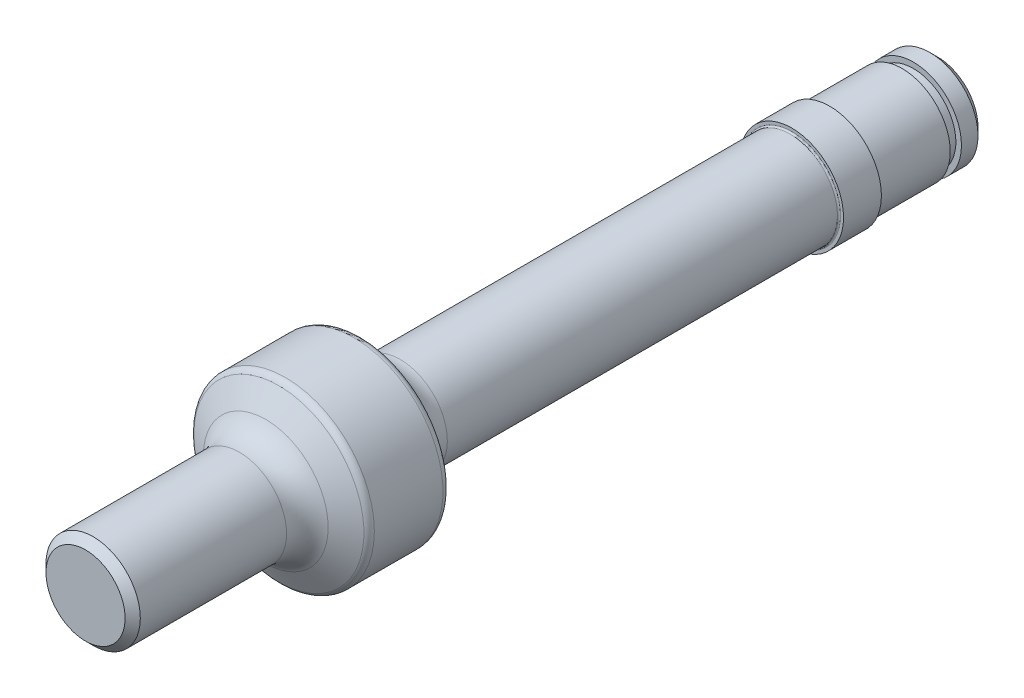
ISO-10303-21;
HEADER;
FILE_DESCRIPTION(('STEP AP214'),'2;1');
FILE_NAME('part.step','',(''),(''),'','','');
FILE_SCHEMA(('AUTOMOTIVE_DESIGN { 1 0 10303 214 1 1 1 1 }'));
ENDSEC;
DATA;
#1=APPLICATION_CONTEXT('core data for automotive mechanical design processes');
#2=APPLICATION_PROTOCOL_DEFINITION('international standard','automotive_design',2000,#1);
#3=PRODUCT_CONTEXT('',#1,'mechanical');
#4=PRODUCT('Part','Part','',(#3));
#5=PRODUCT_RELATED_PRODUCT_CATEGORY('part','',(#4));
#6=PRODUCT_DEFINITION_FORMATION('','',#4);
#7=PRODUCT_DEFINITION_CONTEXT('part definition',#1,'design');
#8=PRODUCT_DEFINITION('design','',#6,#7);
#9=PRODUCT_DEFINITION_SHAPE('','',#8);
#10=(LENGTH_UNIT() NAMED_UNIT(*) SI_UNIT(.MILLI.,.METRE.));
#11=(NAMED_UNIT(*) PLANE_ANGLE_UNIT() SI_UNIT($,.RADIAN.));
#12=(NAMED_UNIT(*) SI_UNIT($,.STERADIAN.) SOLID_ANGLE_UNIT());
#13=UNCERTAINTY_MEASURE_WITH_UNIT(LENGTH_MEASURE(1.E-05),#10,'distance_accuracy_value','');
#14=(GEOMETRIC_REPRESENTATION_CONTEXT(3) GLOBAL_UNCERTAINTY_ASSIGNED_CONTEXT((#13)) GLOBAL_UNIT_ASSIGNED_CONTEXT((#10,
#11,#12)) REPRESENTATION_CONTEXT('',''));
#15=CARTESIAN_POINT('',(0.,0.,0.));
#16=DIRECTION('',(0.,0.,1.));
#17=DIRECTION('',(1.,0.,0.));
#18=AXIS2_PLACEMENT_3D('',#15,#16,#17);
#19=CARTESIAN_POINT('',(0.,3.1623,-40.6019));
#20=DIRECTION('',(0.,0.,1.));
#21=DIRECTION('',(1.,0.,0.));
#22=AXIS2_PLACEMENT_3D('',#19,#20,#21);
#23=PLANE('',#22);
#24=CARTESIAN_POINT('',(0.,0.,-40.6019000000697));
#25=DIRECTION('',(0.,0.,1.));
#26=DIRECTION('',(1.,0.,0.));
#27=AXIS2_PLACEMENT_3D('',#24,#25,#26);
#28=CIRCLE('',#27,2.66229999999723);
#29=CARTESIAN_POINT('',(2.66229999999723,0.,-40.6019000000697));
#30=VERTEX_POINT('',#29);
#31=EDGE_CURVE('E256',#30,#30,#28,.T.);
#32=ORIENTED_EDGE('',*,*,#31,.F.);
#33=EDGE_LOOP('',(#32));
#34=FACE_BOUND('',#33,.T.);
#35=ADVANCED_FACE('F16',(#34),#23,.F.);
#36=CARTESIAN_POINT('',(0.,0.,-40.1019000000247));
#37=DIRECTION('',(0.,0.,1.));
#38=DIRECTION('',(1.,0.,0.));
#39=AXIS2_PLACEMENT_3D('',#36,#37,#38);
#40=CONICAL_SURFACE('',#39,3.16230000004225,0.785398163397448);
#41=ORIENTED_EDGE('',*,*,#31,.T.);
#42=EDGE_LOOP('',(#41));
#43=FACE_BOUND('',#42,.T.);
#44=CARTESIAN_POINT('',(0.,0.,-40.1019));
#45=DIRECTION('',(0.,0.,1.));
#46=DIRECTION('',(1.,0.,0.));
#47=AXIS2_PLACEMENT_3D('',#44,#45,#46);
#48=CIRCLE('',#47,3.1623);
#49=CARTESIAN_POINT('',(3.1623,0.,-40.1019));
#50=VERTEX_POINT('',#49);
#51=EDGE_CURVE('E255',#50,#50,#48,.T.);
#52=ORIENTED_EDGE('',*,*,#51,.F.);
#53=EDGE_LOOP('',(#52));
#54=FACE_BOUND('',#53,.T.);
#55=ADVANCED_FACE('F148',(#43,#54),#40,.T.);
#56=CARTESIAN_POINT('',(0.,0.,26.453846));
#57=DIRECTION('',(0.,0.,1.));
#58=DIRECTION('',(1.,0.,0.));
#59=AXIS2_PLACEMENT_3D('',#56,#57,#58);
#60=CYLINDRICAL_SURFACE('',#59,3.1623);
#61=ORIENTED_EDGE('',*,*,#51,.T.);
#62=EDGE_LOOP('',(#61));
#63=FACE_BOUND('',#62,.T.);
#64=CARTESIAN_POINT('',(0.,0.,-39.0144));
#65=DIRECTION('',(0.,0.,1.));
#66=DIRECTION('',(1.,0.,0.));
#67=AXIS2_PLACEMENT_3D('',#64,#65,#66);
#68=CIRCLE('',#67,3.1623);
#69=CARTESIAN_POINT('',(3.1623,0.,-39.0144));
#70=VERTEX_POINT('',#69);
#71=EDGE_CURVE('E252',#70,#70,#68,.F.);
#72=ORIENTED_EDGE('',*,*,#71,.T.);
#73=EDGE_LOOP('',(#72));
#74=FACE_BOUND('',#73,.T.);
#75=ADVANCED_FACE('F145',(#63,#74),#60,.T.);
#76=CARTESIAN_POINT('',(0.,3.10000000000002,15.3981));
#77=DIRECTION('',(0.,0.,-1.));
#78=DIRECTION('',(-1.,0.,0.));
#79=AXIS2_PLACEMENT_3D('',#76,#77,#78);
#80=PLANE('',#79);
#81=CARTESIAN_POINT('',(0.,0.,15.3980999999703));
#82=DIRECTION('',(0.,0.,-1.));
#83=DIRECTION('',(0.,1.,0.));
#84=AXIS2_PLACEMENT_3D('',#81,#82,#83);
#85=CIRCLE('',#84,2.59999999991578);
#86=CARTESIAN_POINT('',(0.,2.59999999991578,15.3980999999703));
#87=VERTEX_POINT('',#86);
#88=EDGE_CURVE('E249',#87,#87,#85,.T.);
#89=ORIENTED_EDGE('',*,*,#88,.F.);
#90=EDGE_LOOP('',(#89));
#91=FACE_BOUND('',#90,.T.);
#92=ADVANCED_FACE('F141',(#91),#80,.F.);
#93=CARTESIAN_POINT('',(0.,2.794,-39.0144));
#94=DIRECTION('',(0.,0.,-1.));
#95=DIRECTION('',(-1.,0.,0.));
#96=AXIS2_PLACEMENT_3D('',#93,#94,#95);
#97=PLANE('',#96);
#98=CARTESIAN_POINT('',(0.,0.,-39.0144));
#99=DIRECTION('',(0.,0.,-1.));
#100=DIRECTION('',(-1.,0.,0.));
#101=AXIS2_PLACEMENT_3D('',#98,#99,#100);
#102=CIRCLE('',#101,2.794);
#103=CARTESIAN_POINT('',(-2.794,0.,-39.0144));
#104=VERTEX_POINT('',#103);
#105=EDGE_CURVE('E246',#104,#104,#102,.F.);
#106=ORIENTED_EDGE('',*,*,#105,.F.);
#107=EDGE_LOOP('',(#106));
#108=FACE_BOUND('',#107,.T.);
#109=ORIENTED_EDGE('',*,*,#71,.F.);
#110=EDGE_LOOP('',(#109));
#111=FACE_BOUND('',#110,.T.);
#112=ADVANCED_FACE('F137',(#108,#111),#97,.F.);
#113=CARTESIAN_POINT('',(0.,0.,14.8980999999822));
#114=DIRECTION('',(0.,0.,-1.));
#115=DIRECTION('',(0.,1.,0.));
#116=AXIS2_PLACEMENT_3D('',#113,#114,#115);
#117=CONICAL_SURFACE('',#116,3.0999999999608,0.785398163454292);
#118=CARTESIAN_POINT('',(0.,0.,14.8981));
#119=DIRECTION('',(0.,0.,1.));
#120=DIRECTION('',(1.,0.,0.));
#121=AXIS2_PLACEMENT_3D('',#118,#119,#120);
#122=CIRCLE('',#121,3.10000000000001);
#123=CARTESIAN_POINT('',(3.10000000000001,0.,14.8981));
#124=VERTEX_POINT('',#123);
#125=EDGE_CURVE('E245',#124,#124,#122,.F.);
#126=ORIENTED_EDGE('',*,*,#125,.F.);
#127=EDGE_LOOP('',(#126));
#128=FACE_BOUND('',#127,.T.);
#129=ORIENTED_EDGE('',*,*,#88,.T.);
#130=EDGE_LOOP('',(#129));
#131=FACE_BOUND('',#130,.T.);
#132=ADVANCED_FACE('F133',(#128,#131),#117,.T.);
#133=CARTESIAN_POINT('',(0.,0.,-40.0654390361338));
#134=DIRECTION('',(0.,0.,-1.));
#135=DIRECTION('',(-1.,0.,0.));
#136=AXIS2_PLACEMENT_3D('',#133,#134,#135);
#137=CYLINDRICAL_SURFACE('',#136,2.794);
#138=ORIENTED_EDGE('',*,*,#105,.T.);
#139=EDGE_LOOP('',(#138));
#140=FACE_BOUND('',#139,.T.);
#141=CARTESIAN_POINT('',(0.,0.,-38.2778));
#142=DIRECTION('',(0.,0.,-1.));
#143=DIRECTION('',(-1.,0.,0.));
#144=AXIS2_PLACEMENT_3D('',#141,#142,#143);
#145=CIRCLE('',#144,2.794);
#146=CARTESIAN_POINT('',(-2.794,0.,-38.2778));
#147=VERTEX_POINT('',#146);
#148=EDGE_CURVE('E242',#147,#147,#145,.T.);
#149=ORIENTED_EDGE('',*,*,#148,.T.);
#150=EDGE_LOOP('',(#149));
#151=FACE_BOUND('',#150,.T.);
#152=ADVANCED_FACE('F129',(#140,#151),#137,.T.);
#153=CARTESIAN_POINT('',(0.,0.,26.453846));
#154=DIRECTION('',(0.,0.,1.));
#155=DIRECTION('',(1.,0.,0.));
#156=AXIS2_PLACEMENT_3D('',#153,#154,#155);
#157=CYLINDRICAL_SURFACE('',#156,3.10000000000001);
#158=CARTESIAN_POINT('',(0.,0.,5.28374149423676));
#159=DIRECTION('',(0.,0.,1.));
#160=DIRECTION('',(1.,0.,0.));
#161=AXIS2_PLACEMENT_3D('',#158,#159,#160);
#162=CIRCLE('',#161,3.10000000000001);
#163=CARTESIAN_POINT('',(3.10000000000001,0.,5.28374149423676));
#164=VERTEX_POINT('',#163);
#165=EDGE_CURVE('E114',#164,#164,#162,.T.);
#166=ORIENTED_EDGE('',*,*,#165,.T.);
#167=EDGE_LOOP('',(#166));
#168=FACE_BOUND('',#167,.T.);
#169=ORIENTED_EDGE('',*,*,#125,.T.);
#170=EDGE_LOOP('',(#169));
#171=FACE_BOUND('',#170,.T.);
#172=ADVANCED_FACE('F125',(#168,#171),#157,.T.);
#173=CARTESIAN_POINT('',(0.,2.794,-38.2778));
#174=DIRECTION('',(0.,0.,1.));
#175=DIRECTION('',(1.,0.,0.));
#176=AXIS2_PLACEMENT_3D('',#173,#174,#175);
#177=PLANE('',#176);
#178=CARTESIAN_POINT('',(0.,0.,-38.2778));
#179=DIRECTION('',(0.,0.,1.));
#180=DIRECTION('',(1.,0.,0.));
#181=AXIS2_PLACEMENT_3D('',#178,#179,#180);
#182=CIRCLE('',#181,3.1623);
#183=CARTESIAN_POINT('',(3.1623,0.,-38.2778));
#184=VERTEX_POINT('',#183);
#185=EDGE_CURVE('E109',#184,#184,#182,.T.);
#186=ORIENTED_EDGE('',*,*,#185,.F.);
#187=EDGE_LOOP('',(#186));
#188=FACE_BOUND('',#187,.T.);
#189=ORIENTED_EDGE('',*,*,#148,.F.);
#190=EDGE_LOOP('',(#189));
#191=FACE_BOUND('',#190,.T.);
#192=ADVANCED_FACE('F121',(#188,#191),#177,.F.);
#193=CARTESIAN_POINT('',(0.,0.,5.28374149423676));
#194=DIRECTION('',(0.,0.,1.));
#195=DIRECTION('',(1.,0.,0.));
#196=AXIS2_PLACEMENT_3D('',#193,#194,#195);
#197=TOROIDAL_SURFACE('',#196,5.10000000000001,2.);
#198=CARTESIAN_POINT('',(0.,0.,3.55169068666328));
#199=DIRECTION('',(0.,0.,-1.));
#200=DIRECTION('',(-1.,0.,0.));
#201=AXIS2_PLACEMENT_3D('',#198,#199,#200);
#202=CIRCLE('',#201,4.099999999994);
#203=CARTESIAN_POINT('',(-4.099999999994,0.,3.55169068666328));
#204=VERTEX_POINT('',#203);
#205=EDGE_CURVE('E101',#204,#204,#202,.T.);
#206=ORIENTED_EDGE('',*,*,#205,.F.);
#207=EDGE_LOOP('',(#206));
#208=FACE_BOUND('',#207,.T.);
#209=ORIENTED_EDGE('',*,*,#165,.F.);
#210=EDGE_LOOP('',(#209));
#211=FACE_BOUND('',#210,.T.);
#212=ADVANCED_FACE('F117',(#208,#211),#197,.F.);
#213=CARTESIAN_POINT('',(0.,0.,26.453846));
#214=DIRECTION('',(0.,0.,1.));
#215=DIRECTION('',(1.,0.,0.));
#216=AXIS2_PLACEMENT_3D('',#213,#214,#215);
#217=CYLINDRICAL_SURFACE('',#216,3.1623);
#218=CARTESIAN_POINT('',(0.,0.,-33.6153));
#219=DIRECTION('',(0.,0.,1.));
#220=DIRECTION('',(1.,0.,0.));
#221=AXIS2_PLACEMENT_3D('',#218,#219,#220);
#222=CIRCLE('',#221,3.1623);
#223=CARTESIAN_POINT('',(3.1623,0.,-33.6153));
#224=VERTEX_POINT('',#223);
#225=EDGE_CURVE('E90',#224,#224,#222,.F.);
#226=ORIENTED_EDGE('',*,*,#225,.T.);
#227=EDGE_LOOP('',(#226));
#228=FACE_BOUND('',#227,.T.);
#229=ORIENTED_EDGE('',*,*,#185,.T.);
#230=EDGE_LOOP('',(#229));
#231=FACE_BOUND('',#230,.T.);
#232=ADVANCED_FACE('F120',(#228,#231),#217,.T.);
#233=CARTESIAN_POINT('',(0.,0.,2.69028408501981));
#234=DIRECTION('',(0.,0.,-1.));
#235=DIRECTION('',(-1.,0.,0.));
#236=AXIS2_PLACEMENT_3D('',#233,#234,#235);
#237=CONICAL_SURFACE('',#236,5.59199999997873,1.04719755118586);
#238=CARTESIAN_POINT('',(0.,0.,2.69028408503697));
#239=DIRECTION('',(0.,0.,-1.));
#240=DIRECTION('',(-1.,0.,0.));
#241=AXIS2_PLACEMENT_3D('',#238,#239,#240);
#242=CIRCLE('',#241,5.59199999999999);
#243=CARTESIAN_POINT('',(-5.59199999999999,0.,2.69028408503697));
#244=VERTEX_POINT('',#243);
#245=EDGE_CURVE('E57',#244,#244,#242,.T.);
#246=ORIENTED_EDGE('',*,*,#245,.F.);
#247=EDGE_LOOP('',(#246));
#248=FACE_BOUND('',#247,.T.);
#249=ORIENTED_EDGE('',*,*,#205,.T.);
#250=EDGE_LOOP('',(#249));
#251=FACE_BOUND('',#250,.T.);
#252=ADVANCED_FACE('F95',(#248,#251),#237,.T.);
#253=CARTESIAN_POINT('',(0.,0.,-33.6153));
#254=DIRECTION('',(0.,0.,1.));
#255=DIRECTION('',(1.,0.,0.));
#256=AXIS2_PLACEMENT_3D('',#253,#254,#255);
#257=TOROIDAL_SURFACE('',#256,3.2623,0.1);
#258=CARTESIAN_POINT('',(0.,0.,-33.5153));
#259=DIRECTION('',(0.,0.,-1.));
#260=DIRECTION('',(-1.,0.,0.));
#261=AXIS2_PLACEMENT_3D('',#258,#259,#260);
#262=CIRCLE('',#261,3.2623);
#263=CARTESIAN_POINT('',(-3.2623,0.,-33.5153));
#264=VERTEX_POINT('',#263);
#265=CARTESIAN_POINT('',(3.2623,0.,-33.5153));
#266=VERTEX_POINT('',#265);
#267=EDGE_CURVE('E46',#264,#266,#262,.T.);
#268=ORIENTED_EDGE('',*,*,#267,.T.);
#269=CARTESIAN_POINT('',(0.,0.,-33.5153));
#270=DIRECTION('',(0.,0.,-1.));
#271=DIRECTION('',(1.,0.,0.));
#272=AXIS2_PLACEMENT_3D('',#269,#270,#271);
#273=CIRCLE('',#272,3.2623);
#274=EDGE_CURVE('E44',#266,#264,#273,.T.);
#275=ORIENTED_EDGE('',*,*,#274,.T.);
#276=EDGE_LOOP('',(#268,#275));
#277=FACE_BOUND('',#276,.T.);
#278=ORIENTED_EDGE('',*,*,#225,.F.);
#279=EDGE_LOOP('',(#278));
#280=FACE_BOUND('',#279,.T.);
#281=ADVANCED_FACE('F48',(#277,#280),#257,.F.);
#282=CARTESIAN_POINT('',(0.,0.,2.25727138314476));
#283=DIRECTION('',(0.,0.,-1.));
#284=DIRECTION('',(-1.,0.,0.));
#285=AXIS2_PLACEMENT_3D('',#282,#283,#284);
#286=TOROIDAL_SURFACE('',#285,5.34199999999999,0.5);
#287=CARTESIAN_POINT('',(0.,0.,2.25727138314476));
#288=DIRECTION('',(0.,0.,1.));
#289=DIRECTION('',(1.,0.,0.));
#290=AXIS2_PLACEMENT_3D('',#287,#288,#289);
#291=CIRCLE('',#290,5.842);
#292=CARTESIAN_POINT('',(5.842,0.,2.25727138314476));
#293=VERTEX_POINT('',#292);
#294=EDGE_CURVE('E52',#293,#293,#291,.F.);
#295=ORIENTED_EDGE('',*,*,#294,.F.);
#296=EDGE_LOOP('',(#295));
#297=FACE_BOUND('',#296,.T.);
#298=ORIENTED_EDGE('',*,*,#245,.T.);
#299=EDGE_LOOP('',(#298));
#300=FACE_BOUND('',#299,.T.);
#301=ADVANCED_FACE('F75',(#297,#300),#286,.T.);
#302=CARTESIAN_POINT('',(0.,3.4,-33.5153));
#303=DIRECTION('',(0.,0.,1.));
#304=DIRECTION('',(1.,0.,0.));
#305=AXIS2_PLACEMENT_3D('',#302,#303,#304);
#306=PLANE('',#305);
#307=CARTESIAN_POINT('',(0.,0.,-33.5153));
#308=DIRECTION('',(0.,0.,1.));
#309=DIRECTION('',(1.,0.,0.));
#310=AXIS2_PLACEMENT_3D('',#307,#308,#309);
#311=CIRCLE('',#310,3.4);
#312=CARTESIAN_POINT('',(3.4,0.,-33.5153));
#313=VERTEX_POINT('',#312);
#314=EDGE_CURVE('E228',#313,#313,#311,.T.);
#315=ORIENTED_EDGE('',*,*,#314,.F.);
#316=EDGE_LOOP('',(#315));
#317=FACE_BOUND('',#316,.T.);
#318=ORIENTED_EDGE('',*,*,#274,.F.);
#319=ORIENTED_EDGE('',*,*,#267,.F.);
#320=EDGE_LOOP('',(#318,#319));
#321=FACE_BOUND('',#320,.T.);
#322=ADVANCED_FACE('F56',(#317,#321),#306,.F.);
#323=CARTESIAN_POINT('',(0.,0.,26.453846));
#324=DIRECTION('',(0.,0.,1.));
#325=DIRECTION('',(1.,0.,0.));
#326=AXIS2_PLACEMENT_3D('',#323,#324,#325);
#327=CYLINDRICAL_SURFACE('',#326,5.842);
#328=CARTESIAN_POINT('',(0.,0.,-2.25727138314476));
#329=DIRECTION('',(0.,0.,-1.));
#330=DIRECTION('',(-1.,0.,0.));
#331=AXIS2_PLACEMENT_3D('',#328,#329,#330);
#332=CIRCLE('',#331,5.842);
#333=CARTESIAN_POINT('',(-5.842,0.,-2.25727138314476));
#334=VERTEX_POINT('',#333);
#335=EDGE_CURVE('E225',#334,#334,#332,.T.);
#336=ORIENTED_EDGE('',*,*,#335,.F.);
#337=EDGE_LOOP('',(#336));
#338=FACE_BOUND('',#337,.T.);
#339=ORIENTED_EDGE('',*,*,#294,.T.);
#340=EDGE_LOOP('',(#339));
#341=FACE_BOUND('',#340,.T.);
#342=ADVANCED_FACE('F74',(#338,#341),#327,.T.);
#343=CARTESIAN_POINT('',(0.,0.,26.453846));
#344=DIRECTION('',(0.,0.,1.));
#345=DIRECTION('',(1.,0.,0.));
#346=AXIS2_PLACEMENT_3D('',#343,#344,#345);
#347=CYLINDRICAL_SURFACE('',#346,3.4);
#348=CARTESIAN_POINT('',(0.,0.,-31.0261));
#349=DIRECTION('',(0.,0.,1.));
#350=DIRECTION('',(1.,0.,0.));
#351=AXIS2_PLACEMENT_3D('',#348,#349,#350);
#352=CIRCLE('',#351,3.4);
#353=CARTESIAN_POINT('',(3.4,0.,-31.0261));
#354=VERTEX_POINT('',#353);
#355=EDGE_CURVE('E227',#354,#354,#352,.F.);
#356=ORIENTED_EDGE('',*,*,#355,.T.);
#357=EDGE_LOOP('',(#356));
#358=FACE_BOUND('',#357,.T.);
#359=ORIENTED_EDGE('',*,*,#314,.T.);
#360=EDGE_LOOP('',(#359));
#361=FACE_BOUND('',#360,.T.);
#362=ADVANCED_FACE('F281',(#358,#361),#347,.T.);
#363=CARTESIAN_POINT('',(0.,0.,-2.25727138314476));
#364=DIRECTION('',(0.,0.,-1.));
#365=DIRECTION('',(-1.,0.,0.));
#366=AXIS2_PLACEMENT_3D('',#363,#364,#365);
#367=TOROIDAL_SURFACE('',#366,5.34199999999999,0.5);
#368=CARTESIAN_POINT('',(0.,0.,-2.69028408501981));
#369=DIRECTION('',(0.,0.,1.));
#370=DIRECTION('',(1.,0.,0.));
#371=AXIS2_PLACEMENT_3D('',#368,#369,#370);
#372=CIRCLE('',#371,5.59199999997873);
#373=CARTESIAN_POINT('',(5.59199999997872,0.,-2.69028408501981));
#374=VERTEX_POINT('',#373);
#375=EDGE_CURVE('E184',#374,#374,#372,.F.);
#376=ORIENTED_EDGE('',*,*,#375,.F.);
#377=EDGE_LOOP('',(#376));
#378=FACE_BOUND('',#377,.T.);
#379=ORIENTED_EDGE('',*,*,#335,.T.);
#380=EDGE_LOOP('',(#379));
#381=FACE_BOUND('',#380,.T.);
#382=ADVANCED_FACE('F202',(#378,#381),#367,.T.);
#383=CARTESIAN_POINT('',(0.,3.4,-31.0261));
#384=DIRECTION('',(0.,0.,-1.));
#385=DIRECTION('',(-1.,0.,0.));
#386=AXIS2_PLACEMENT_3D('',#383,#384,#385);
#387=PLANE('',#386);
#388=ORIENTED_EDGE('',*,*,#355,.F.);
#389=EDGE_LOOP('',(#388));
#390=FACE_BOUND('',#389,.T.);
#391=CARTESIAN_POINT('',(0.,0.,-31.0261));
#392=DIRECTION('',(0.,0.,1.));
#393=DIRECTION('',(-1.,0.,0.));
#394=AXIS2_PLACEMENT_3D('',#391,#392,#393);
#395=CIRCLE('',#394,3.19999999999995);
#396=CARTESIAN_POINT('',(3.19999999999995,0.,-31.0261));
#397=VERTEX_POINT('',#396);
#398=CARTESIAN_POINT('',(-3.19999999999995,0.,-31.0261));
#399=VERTEX_POINT('',#398);
#400=EDGE_CURVE('E181',#397,#399,#395,.F.);
#401=ORIENTED_EDGE('',*,*,#400,.T.);
#402=CARTESIAN_POINT('',(0.,0.,-31.0261));
#403=DIRECTION('',(0.,0.,1.));
#404=DIRECTION('',(1.,0.,0.));
#405=AXIS2_PLACEMENT_3D('',#402,#403,#404);
#406=CIRCLE('',#405,3.19999999999995);
#407=EDGE_CURVE('E35',#399,#397,#406,.F.);
#408=ORIENTED_EDGE('',*,*,#407,.T.);
#409=EDGE_LOOP('',(#401,#408));
#410=FACE_BOUND('',#409,.T.);
#411=ADVANCED_FACE('F192',(#390,#410),#387,.F.);
#412=CARTESIAN_POINT('',(0.,0.,-2.69028408507666));
#413=DIRECTION('',(0.,0.,1.));
#414=DIRECTION('',(1.,0.,0.));
#415=AXIS2_PLACEMENT_3D('',#412,#413,#414);
#416=CONICAL_SURFACE('',#415,5.59199999992188,1.04719755119794);
#417=ORIENTED_EDGE('',*,*,#375,.T.);
#418=EDGE_LOOP('',(#417));
#419=FACE_BOUND('',#418,.T.);
#420=CARTESIAN_POINT('',(0.,0.,-3.55169068666792));
#421=DIRECTION('',(0.,0.,1.));
#422=DIRECTION('',(1.,0.,0.));
#423=AXIS2_PLACEMENT_3D('',#420,#421,#422);
#424=CIRCLE('',#423,4.09999999999995);
#425=CARTESIAN_POINT('',(4.09999999999995,0.,-3.55169068666792));
#426=VERTEX_POINT('',#425);
#427=EDGE_CURVE('E179',#426,#426,#424,.T.);
#428=ORIENTED_EDGE('',*,*,#427,.T.);
#429=EDGE_LOOP('',(#428));
#430=FACE_BOUND('',#429,.T.);
#431=ADVANCED_FACE('F201',(#419,#430),#416,.T.);
#432=CARTESIAN_POINT('',(0.,0.,-30.9261));
#433=DIRECTION('',(0.,0.,-1.));
#434=DIRECTION('',(-1.,0.,0.));
#435=AXIS2_PLACEMENT_3D('',#432,#433,#434);
#436=TOROIDAL_SURFACE('',#435,3.19999999999995,0.1);
#437=CARTESIAN_POINT('',(0.,0.,-30.9261));
#438=DIRECTION('',(0.,0.,1.));
#439=DIRECTION('',(1.,0.,0.));
#440=AXIS2_PLACEMENT_3D('',#437,#438,#439);
#441=CIRCLE('',#440,3.09999999999995);
#442=CARTESIAN_POINT('',(3.09999999999995,0.,-30.9261));
#443=VERTEX_POINT('',#442);
#444=EDGE_CURVE('E27',#443,#443,#441,.T.);
#445=ORIENTED_EDGE('',*,*,#444,.F.);
#446=EDGE_LOOP('',(#445));
#447=FACE_BOUND('',#446,.T.);
#448=ORIENTED_EDGE('',*,*,#400,.F.);
#449=ORIENTED_EDGE('',*,*,#407,.F.);
#450=EDGE_LOOP('',(#448,#449));
#451=FACE_BOUND('',#450,.T.);
#452=ADVANCED_FACE('F167',(#447,#451),#436,.F.);
#453=CARTESIAN_POINT('',(0.,0.,-5.2837414942368));
#454=DIRECTION('',(0.,0.,1.));
#455=DIRECTION('',(1.,0.,0.));
#456=AXIS2_PLACEMENT_3D('',#453,#454,#455);
#457=TOROIDAL_SURFACE('',#456,5.09999999999995,2.);
#458=CARTESIAN_POINT('',(0.,0.,-5.2837414942368));
#459=DIRECTION('',(0.,0.,1.));
#460=DIRECTION('',(1.,0.,0.));
#461=AXIS2_PLACEMENT_3D('',#458,#459,#460);
#462=CIRCLE('',#461,3.09999999999995);
#463=CARTESIAN_POINT('',(3.09999999999995,0.,-5.2837414942368));
#464=VERTEX_POINT('',#463);
#465=EDGE_CURVE('E11',#464,#464,#462,.F.);
#466=ORIENTED_EDGE('',*,*,#465,.F.);
#467=EDGE_LOOP('',(#466));
#468=FACE_BOUND('',#467,.T.);
#469=ORIENTED_EDGE('',*,*,#427,.F.);
#470=EDGE_LOOP('',(#469));
#471=FACE_BOUND('',#470,.T.);
#472=ADVANCED_FACE('F161',(#468,#471),#457,.F.);
#473=CARTESIAN_POINT('',(0.,0.,26.453846));
#474=DIRECTION('',(0.,0.,1.));
#475=DIRECTION('',(1.,0.,0.));
#476=AXIS2_PLACEMENT_3D('',#473,#474,#475);
#477=CYLINDRICAL_SURFACE('',#476,3.09999999999995);
#478=ORIENTED_EDGE('',*,*,#444,.T.);
#479=EDGE_LOOP('',(#478));
#480=FACE_BOUND('',#479,.T.);
#481=ORIENTED_EDGE('',*,*,#465,.T.);
#482=EDGE_LOOP('',(#481));
#483=FACE_BOUND('',#482,.T.);
#484=ADVANCED_FACE('F159',(#480,#483),#477,.T.);
#485=CLOSED_SHELL('',(#35,#55,#75,#92,#112,#132,#152,#172,#192,#212,#232,#252,#281,#301,#322,
#342,#362,#382,#411,#431,#452,#472,#484));
#486=MANIFOLD_SOLID_BREP('B1',#485);
#487=ADVANCED_BREP_SHAPE_REPRESENTATION('',(#18,#486),#14);
#488=SHAPE_DEFINITION_REPRESENTATION(#9,#487);
ENDSEC;
END-ISO-10303-21;
